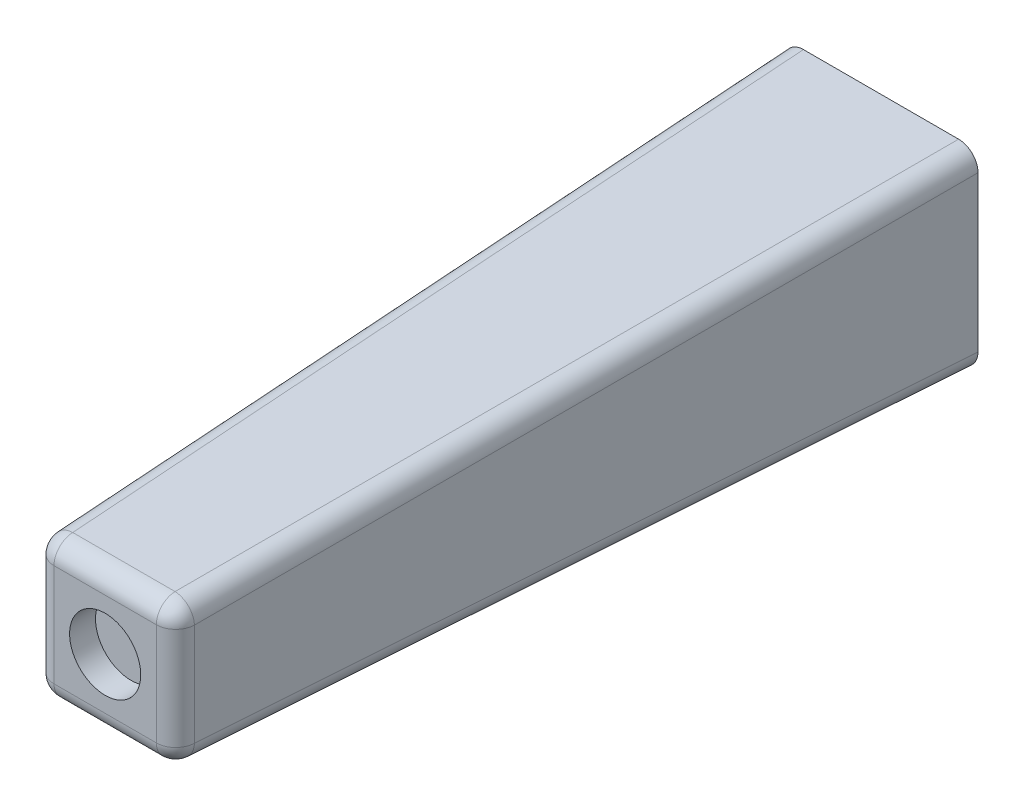
ISO-10303-21;
HEADER;
FILE_DESCRIPTION(('STEP AP214'),'2;1');
FILE_NAME('part.step','',(''),(''),'','','');
FILE_SCHEMA(('AUTOMOTIVE_DESIGN { 1 0 10303 214 1 1 1 1 }'));
ENDSEC;
DATA;
#1=APPLICATION_CONTEXT('core data for automotive mechanical design processes');
#2=APPLICATION_PROTOCOL_DEFINITION('international standard','automotive_design',2000,#1);
#3=PRODUCT_CONTEXT('',#1,'mechanical');
#4=PRODUCT('Part','Part','',(#3));
#5=PRODUCT_RELATED_PRODUCT_CATEGORY('part','',(#4));
#6=PRODUCT_DEFINITION_FORMATION('','',#4);
#7=PRODUCT_DEFINITION_CONTEXT('part definition',#1,'design');
#8=PRODUCT_DEFINITION('design','',#6,#7);
#9=PRODUCT_DEFINITION_SHAPE('','',#8);
#10=(LENGTH_UNIT() NAMED_UNIT(*) SI_UNIT(.MILLI.,.METRE.));
#11=(NAMED_UNIT(*) PLANE_ANGLE_UNIT() SI_UNIT($,.RADIAN.));
#12=(NAMED_UNIT(*) SI_UNIT($,.STERADIAN.) SOLID_ANGLE_UNIT());
#13=UNCERTAINTY_MEASURE_WITH_UNIT(LENGTH_MEASURE(1.E-05),#10,'distance_accuracy_value','');
#14=(GEOMETRIC_REPRESENTATION_CONTEXT(3) GLOBAL_UNCERTAINTY_ASSIGNED_CONTEXT((#13)) GLOBAL_UNIT_ASSIGNED_CONTEXT((#10,
#11,#12)) REPRESENTATION_CONTEXT('',''));
#15=CARTESIAN_POINT('',(0.,0.,0.));
#16=DIRECTION('',(0.,0.,1.));
#17=DIRECTION('',(1.,0.,0.));
#18=AXIS2_PLACEMENT_3D('',#15,#16,#17);
#19=CARTESIAN_POINT('',(7.5,-7.5,0.));
#20=DIRECTION('',(0.999390827019096,0.,0.034899496702501));
#21=DIRECTION('',(0.034899496702501,0.,-0.999390827019096));
#22=AXIS2_PLACEMENT_3D('',#19,#20,#21);
#23=PLANE('',#22);
#24=DIRECTION('',(0.,1.,0.));
#25=VECTOR('',#24,1.);
#26=CARTESIAN_POINT('',(7.5,-7.5,0.));
#27=LINE('',#26,#25);
#28=CARTESIAN_POINT('',(7.5,-6.00091375947136,0.));
#29=VERTEX_POINT('',#28);
#30=CARTESIAN_POINT('',(7.5,6.00091375947136,0.));
#31=VERTEX_POINT('',#30);
#32=EDGE_CURVE('E221',#29,#31,#27,.T.);
#33=ORIENTED_EDGE('',*,*,#32,.T.);
#34=DIRECTION('',(-0.0348782627423747,-0.0348782627423747,0.998782765958718));
#35=VECTOR('',#34,1.);
#36=CARTESIAN_POINT('',(7.4835762300568,5.98448998952816,0.470315235953722));
#37=LINE('',#36,#35);
#38=CARTESIAN_POINT('',(5.45530690881317,3.95622066828452,58.5523492450537));
#39=VERTEX_POINT('',#38);
#40=EDGE_CURVE('E168',#31,#39,#37,.T.);
#41=ORIENTED_EDGE('',*,*,#40,.T.);
#42=DIRECTION('',(0.,1.,0.));
#43=VECTOR('',#42,1.);
#44=CARTESIAN_POINT('',(5.45530690881316,-7.5,58.5523492450537));
#45=LINE('',#44,#43);
#46=CARTESIAN_POINT('',(5.45530690881317,-3.95622066828452,58.5523492450537));
#47=VERTEX_POINT('',#46);
#48=EDGE_CURVE('E166',#39,#47,#45,.F.);
#49=ORIENTED_EDGE('',*,*,#48,.T.);
#50=DIRECTION('',(-0.0348782627423747,0.0348782627423747,0.998782765958718));
#51=VECTOR('',#50,1.);
#52=CARTESIAN_POINT('',(7.50182362823569,-6.00273738770705,-0.0522218800512369));
#53=LINE('',#52,#51);
#54=EDGE_CURVE('E164',#47,#29,#53,.F.);
#55=ORIENTED_EDGE('',*,*,#54,.T.);
#56=EDGE_LOOP('',(#33,#41,#49,#55));
#57=FACE_BOUND('',#56,.T.);
#58=ADVANCED_FACE('F41',(#57),#23,.T.);
#59=CARTESIAN_POINT('',(-7.5,7.5,0.));
#60=DIRECTION('',(0.,0.999390827019096,0.034899496702501));
#61=DIRECTION('',(0.,-0.034899496702501,0.999390827019096));
#62=AXIS2_PLACEMENT_3D('',#59,#60,#61);
#63=PLANE('',#62);
#64=DIRECTION('',(-1.,0.,0.));
#65=VECTOR('',#64,1.);
#66=CARTESIAN_POINT('',(-7.5,5.45530690881316,58.5523492450537));
#67=LINE('',#66,#65);
#68=CARTESIAN_POINT('',(-3.95622066828452,5.45530690881316,58.5523492450537));
#69=VERTEX_POINT('',#68);
#70=CARTESIAN_POINT('',(3.95622066828452,5.45530690881317,58.5523492450537));
#71=VERTEX_POINT('',#70);
#72=EDGE_CURVE('E126',#69,#71,#67,.F.);
#73=ORIENTED_EDGE('',*,*,#72,.T.);
#74=DIRECTION('',(-0.0348782627423747,-0.0348782627423747,0.998782765958718));
#75=VECTOR('',#74,1.);
#76=CARTESIAN_POINT('',(5.98448998952816,7.4835762300568,0.470315235953722));
#77=LINE('',#76,#75);
#78=CARTESIAN_POINT('',(6.00091375947136,7.5,0.));
#79=VERTEX_POINT('',#78);
#80=EDGE_CURVE('E162',#71,#79,#77,.F.);
#81=ORIENTED_EDGE('',*,*,#80,.T.);
#82=DIRECTION('',(-1.,0.,0.));
#83=VECTOR('',#82,1.);
#84=CARTESIAN_POINT('',(-7.5,7.5,0.));
#85=LINE('',#84,#83);
#86=CARTESIAN_POINT('',(-6.00091375947135,7.5,0.));
#87=VERTEX_POINT('',#86);
#88=EDGE_CURVE('E226',#79,#87,#85,.T.);
#89=ORIENTED_EDGE('',*,*,#88,.T.);
#90=DIRECTION('',(0.0348782627423747,-0.0348782627423747,0.998782765958718));
#91=VECTOR('',#90,1.);
#92=CARTESIAN_POINT('',(-6.00273738770705,7.50182362823569,-0.0522218800512369));
#93=LINE('',#92,#91);
#94=EDGE_CURVE('E155',#87,#69,#93,.T.);
#95=ORIENTED_EDGE('',*,*,#94,.T.);
#96=EDGE_LOOP('',(#73,#81,#89,#95));
#97=FACE_BOUND('',#96,.T.);
#98=ADVANCED_FACE('F251',(#97),#63,.T.);
#99=CARTESIAN_POINT('',(-7.5,-7.5,0.));
#100=DIRECTION('',(-0.999390827019096,0.,0.034899496702501));
#101=DIRECTION('',(0.034899496702501,0.,0.999390827019096));
#102=AXIS2_PLACEMENT_3D('',#99,#100,#101);
#103=PLANE('',#102);
#104=DIRECTION('',(0.,-1.,0.));
#105=VECTOR('',#104,1.);
#106=CARTESIAN_POINT('',(-7.5,-7.5,0.));
#107=LINE('',#106,#105);
#108=CARTESIAN_POINT('',(-7.5,6.00091375947135,0.));
#109=VERTEX_POINT('',#108);
#110=CARTESIAN_POINT('',(-7.5,-6.00091375947136,0.));
#111=VERTEX_POINT('',#110);
#112=EDGE_CURVE('E229',#109,#111,#107,.T.);
#113=ORIENTED_EDGE('',*,*,#112,.T.);
#114=DIRECTION('',(0.0348782627423747,0.0348782627423747,0.998782765958718));
#115=VECTOR('',#114,1.);
#116=CARTESIAN_POINT('',(-7.50182362823569,-6.00273738770705,-0.0522218800512369));
#117=LINE('',#116,#115);
#118=CARTESIAN_POINT('',(-5.45530690881316,-3.95622066828452,58.5523492450537));
#119=VERTEX_POINT('',#118);
#120=EDGE_CURVE('E58',#111,#119,#117,.T.);
#121=ORIENTED_EDGE('',*,*,#120,.T.);
#122=DIRECTION('',(0.,-1.,0.));
#123=VECTOR('',#122,1.);
#124=CARTESIAN_POINT('',(-5.45530690881316,-7.5,58.5523492450537));
#125=LINE('',#124,#123);
#126=CARTESIAN_POINT('',(-5.45530690881316,3.95622066828452,58.5523492450537));
#127=VERTEX_POINT('',#126);
#128=EDGE_CURVE('E63',#119,#127,#125,.F.);
#129=ORIENTED_EDGE('',*,*,#128,.T.);
#130=DIRECTION('',(0.0348782627423747,-0.0348782627423747,0.998782765958718));
#131=VECTOR('',#130,1.);
#132=CARTESIAN_POINT('',(-7.4835762300568,5.98448998952816,0.470315235953721));
#133=LINE('',#132,#131);
#134=EDGE_CURVE('E176',#127,#109,#133,.F.);
#135=ORIENTED_EDGE('',*,*,#134,.T.);
#136=EDGE_LOOP('',(#113,#121,#129,#135));
#137=FACE_BOUND('',#136,.T.);
#138=ADVANCED_FACE('F257',(#137),#103,.T.);
#139=CARTESIAN_POINT('',(-7.5,-7.5,0.));
#140=DIRECTION('',(0.,-0.999390827019096,0.034899496702501));
#141=DIRECTION('',(0.,-0.034899496702501,-0.999390827019096));
#142=AXIS2_PLACEMENT_3D('',#139,#140,#141);
#143=PLANE('',#142);
#144=DIRECTION('',(1.,0.,0.));
#145=VECTOR('',#144,1.);
#146=CARTESIAN_POINT('',(-7.5,-5.45530690881316,58.5523492450537));
#147=LINE('',#146,#145);
#148=CARTESIAN_POINT('',(3.95622066828452,-5.45530690881316,58.5523492450537));
#149=VERTEX_POINT('',#148);
#150=CARTESIAN_POINT('',(-3.95622066828452,-5.45530690881316,58.5523492450537));
#151=VERTEX_POINT('',#150);
#152=EDGE_CURVE('E172',#149,#151,#147,.F.);
#153=ORIENTED_EDGE('',*,*,#152,.T.);
#154=DIRECTION('',(0.0348782627423747,0.0348782627423747,0.998782765958718));
#155=VECTOR('',#154,1.);
#156=CARTESIAN_POINT('',(-6.00273738770705,-7.50182362823569,-0.0522218800512369));
#157=LINE('',#156,#155);
#158=CARTESIAN_POINT('',(-6.00091375947136,-7.5,0.));
#159=VERTEX_POINT('',#158);
#160=EDGE_CURVE('E174',#151,#159,#157,.F.);
#161=ORIENTED_EDGE('',*,*,#160,.T.);
#162=DIRECTION('',(1.,0.,0.));
#163=VECTOR('',#162,1.);
#164=CARTESIAN_POINT('',(-7.5,-7.5,0.));
#165=LINE('',#164,#163);
#166=CARTESIAN_POINT('',(6.00091375947136,-7.5,0.));
#167=VERTEX_POINT('',#166);
#168=EDGE_CURVE('E148',#159,#167,#165,.T.);
#169=ORIENTED_EDGE('',*,*,#168,.T.);
#170=DIRECTION('',(-0.0348782627423747,0.0348782627423747,0.998782765958718));
#171=VECTOR('',#170,1.);
#172=CARTESIAN_POINT('',(5.98448998952816,-7.4835762300568,0.470315235953722));
#173=LINE('',#172,#171);
#174=EDGE_CURVE('E170',#167,#149,#173,.T.);
#175=ORIENTED_EDGE('',*,*,#174,.T.);
#176=EDGE_LOOP('',(#153,#161,#169,#175));
#177=FACE_BOUND('',#176,.T.);
#178=ADVANCED_FACE('F286',(#177),#143,.T.);
#179=CARTESIAN_POINT('',(0.,0.,60.));
#180=DIRECTION('',(0.,0.,-1.));
#181=DIRECTION('',(-1.,0.,0.));
#182=AXIS2_PLACEMENT_3D('',#179,#180,#181);
#183=PLANE('',#182);
#184=DIRECTION('',(0.,-1.,0.));
#185=VECTOR('',#184,1.);
#186=CARTESIAN_POINT('',(3.95622066828452,0.,60.));
#187=LINE('',#186,#185);
#188=CARTESIAN_POINT('',(3.95622066828452,-3.95622066828452,60.));
#189=VERTEX_POINT('',#188);
#190=CARTESIAN_POINT('',(3.95622066828452,3.95622066828452,60.));
#191=VERTEX_POINT('',#190);
#192=EDGE_CURVE('E153',#189,#191,#187,.F.);
#193=ORIENTED_EDGE('',*,*,#192,.T.);
#194=DIRECTION('',(1.,0.,0.));
#195=VECTOR('',#194,1.);
#196=CARTESIAN_POINT('',(0.,3.95622066828452,60.));
#197=LINE('',#196,#195);
#198=CARTESIAN_POINT('',(-3.95622066828452,3.95622066828452,60.));
#199=VERTEX_POINT('',#198);
#200=EDGE_CURVE('E124',#191,#199,#197,.F.);
#201=ORIENTED_EDGE('',*,*,#200,.T.);
#202=DIRECTION('',(0.,1.,0.));
#203=VECTOR('',#202,1.);
#204=CARTESIAN_POINT('',(-3.95622066828452,0.,60.));
#205=LINE('',#204,#203);
#206=CARTESIAN_POINT('',(-3.95622066828452,-3.95622066828452,60.));
#207=VERTEX_POINT('',#206);
#208=EDGE_CURVE('E141',#199,#207,#205,.F.);
#209=ORIENTED_EDGE('',*,*,#208,.T.);
#210=DIRECTION('',(-1.,0.,0.));
#211=VECTOR('',#210,1.);
#212=CARTESIAN_POINT('',(0.,-3.95622066828452,60.));
#213=LINE('',#212,#211);
#214=EDGE_CURVE('E147',#207,#189,#213,.F.);
#215=ORIENTED_EDGE('',*,*,#214,.T.);
#216=EDGE_LOOP('',(#193,#201,#209,#215));
#217=FACE_BOUND('',#216,.T.);
#218=CARTESIAN_POINT('',(0.,0.,60.));
#219=DIRECTION('',(0.,0.,1.));
#220=DIRECTION('',(1.,0.,0.));
#221=AXIS2_PLACEMENT_3D('',#218,#219,#220);
#222=CIRCLE('',#221,2.75);
#223=CARTESIAN_POINT('',(2.75,0.,60.));
#224=VERTEX_POINT('',#223);
#225=EDGE_CURVE('E207',#224,#224,#222,.T.);
#226=ORIENTED_EDGE('',*,*,#225,.F.);
#227=EDGE_LOOP('',(#226));
#228=FACE_BOUND('',#227,.T.);
#229=ADVANCED_FACE('F150',(#217,#228),#183,.F.);
#230=CARTESIAN_POINT('',(0.,0.,0.));
#231=DIRECTION('',(0.,0.,-1.));
#232=DIRECTION('',(-1.,0.,0.));
#233=AXIS2_PLACEMENT_3D('',#230,#231,#232);
#234=PLANE('',#233);
#235=CARTESIAN_POINT('',(0.,0.,0.));
#236=DIRECTION('',(0.,0.,-1.));
#237=DIRECTION('',(-1.,0.,0.));
#238=AXIS2_PLACEMENT_3D('',#235,#236,#237);
#239=CIRCLE('',#238,1.5);
#240=CARTESIAN_POINT('',(-1.5,0.,0.));
#241=VERTEX_POINT('',#240);
#242=EDGE_CURVE('E215',#241,#241,#239,.T.);
#243=ORIENTED_EDGE('',*,*,#242,.F.);
#244=EDGE_LOOP('',(#243));
#245=FACE_BOUND('',#244,.T.);
#246=ORIENTED_EDGE('',*,*,#168,.F.);
#247=CARTESIAN_POINT('',(-5.99908568355177,-5.99908568355177,0.));
#248=DIRECTION('',(0.,0.,-1.));
#249=DIRECTION('',(-0.707106781186548,-0.707106781186547,0.));
#250=AXIS2_PLACEMENT_3D('',#247,#248,#249);
#251=ELLIPSE('',#250,1.50182807625857,1.5);
#252=EDGE_CURVE('E11',#159,#111,#251,.T.);
#253=ORIENTED_EDGE('',*,*,#252,.T.);
#254=ORIENTED_EDGE('',*,*,#112,.F.);
#255=CARTESIAN_POINT('',(-5.99908568355177,5.99908568355177,0.));
#256=DIRECTION('',(0.,0.,-1.));
#257=DIRECTION('',(-0.707106781186548,0.707106781186548,0.));
#258=AXIS2_PLACEMENT_3D('',#255,#256,#257);
#259=ELLIPSE('',#258,1.50182807625857,1.5);
#260=EDGE_CURVE('E182',#109,#87,#259,.T.);
#261=ORIENTED_EDGE('',*,*,#260,.T.);
#262=ORIENTED_EDGE('',*,*,#88,.F.);
#263=CARTESIAN_POINT('',(5.99908568355177,5.99908568355177,0.));
#264=DIRECTION('',(0.,0.,-1.));
#265=DIRECTION('',(0.707106781186548,0.707106781186548,0.));
#266=AXIS2_PLACEMENT_3D('',#263,#264,#265);
#267=ELLIPSE('',#266,1.50182807625857,1.5);
#268=EDGE_CURVE('E50',#79,#31,#267,.T.);
#269=ORIENTED_EDGE('',*,*,#268,.T.);
#270=ORIENTED_EDGE('',*,*,#32,.F.);
#271=CARTESIAN_POINT('',(5.99908568355177,-5.99908568355177,0.));
#272=DIRECTION('',(0.,0.,-1.));
#273=DIRECTION('',(0.707106781186547,-0.707106781186548,0.));
#274=AXIS2_PLACEMENT_3D('',#271,#272,#273);
#275=ELLIPSE('',#274,1.50182807625857,1.5);
#276=EDGE_CURVE('E180',#29,#167,#275,.T.);
#277=ORIENTED_EDGE('',*,*,#276,.T.);
#278=EDGE_LOOP('',(#246,#253,#254,#261,#262,#269,#270,#277));
#279=FACE_BOUND('',#278,.T.);
#280=ADVANCED_FACE('F260',(#245,#279),#234,.T.);
#281=CARTESIAN_POINT('',(0.,0.,10.));
#282=DIRECTION('',(0.,0.,-1.));
#283=DIRECTION('',(-1.,0.,0.));
#284=AXIS2_PLACEMENT_3D('',#281,#282,#283);
#285=CYLINDRICAL_SURFACE('',#284,1.5);
#286=CARTESIAN_POINT('',(0.,0.,10.));
#287=DIRECTION('',(0.,0.,-1.));
#288=DIRECTION('',(-1.,0.,0.));
#289=AXIS2_PLACEMENT_3D('',#286,#287,#288);
#290=CIRCLE('',#289,1.5);
#291=CARTESIAN_POINT('',(-1.5,0.,10.));
#292=VERTEX_POINT('',#291);
#293=EDGE_CURVE('E218',#292,#292,#290,.T.);
#294=ORIENTED_EDGE('',*,*,#293,.F.);
#295=EDGE_LOOP('',(#294));
#296=FACE_BOUND('',#295,.T.);
#297=ORIENTED_EDGE('',*,*,#242,.T.);
#298=EDGE_LOOP('',(#297));
#299=FACE_BOUND('',#298,.T.);
#300=ADVANCED_FACE('F397',(#296,#299),#285,.F.);
#301=CARTESIAN_POINT('',(0.,0.,10.));
#302=DIRECTION('',(0.,0.,-1.));
#303=DIRECTION('',(-1.,0.,0.));
#304=AXIS2_PLACEMENT_3D('',#301,#302,#303);
#305=PLANE('',#304);
#306=ORIENTED_EDGE('',*,*,#293,.T.);
#307=EDGE_LOOP('',(#306));
#308=FACE_BOUND('',#307,.T.);
#309=ADVANCED_FACE('F388',(#308),#305,.T.);
#310=CARTESIAN_POINT('',(0.,0.,58.));
#311=DIRECTION('',(0.,0.,1.));
#312=DIRECTION('',(1.,0.,0.));
#313=AXIS2_PLACEMENT_3D('',#310,#311,#312);
#314=CYLINDRICAL_SURFACE('',#313,2.75);
#315=CARTESIAN_POINT('',(0.,0.,58.));
#316=DIRECTION('',(0.,0.,1.));
#317=DIRECTION('',(1.,0.,0.));
#318=AXIS2_PLACEMENT_3D('',#315,#316,#317);
#319=CIRCLE('',#318,2.75);
#320=CARTESIAN_POINT('',(2.75,0.,58.));
#321=VERTEX_POINT('',#320);
#322=EDGE_CURVE('E210',#321,#321,#319,.T.);
#323=ORIENTED_EDGE('',*,*,#322,.F.);
#324=EDGE_LOOP('',(#323));
#325=FACE_BOUND('',#324,.T.);
#326=ORIENTED_EDGE('',*,*,#225,.T.);
#327=EDGE_LOOP('',(#326));
#328=FACE_BOUND('',#327,.T.);
#329=ADVANCED_FACE('F379',(#325,#328),#314,.F.);
#330=CARTESIAN_POINT('',(0.,0.,58.));
#331=DIRECTION('',(0.,0.,1.));
#332=DIRECTION('',(1.,0.,0.));
#333=AXIS2_PLACEMENT_3D('',#330,#331,#332);
#334=PLANE('',#333);
#335=ORIENTED_EDGE('',*,*,#322,.T.);
#336=EDGE_LOOP('',(#335));
#337=FACE_BOUND('',#336,.T.);
#338=ADVANCED_FACE('F372',(#337),#334,.T.);
#339=CARTESIAN_POINT('',(6.00273738770705,-6.00273738770705,-0.104571125104988));
#340=DIRECTION('',(0.0348782627423747,-0.0348782627423747,-0.998782765958718));
#341=DIRECTION('',(0.,0.999390827019096,-0.034899496702501));
#342=AXIS2_PLACEMENT_3D('',#339,#340,#341);
#343=CYLINDRICAL_SURFACE('',#342,1.5);
#344=ORIENTED_EDGE('',*,*,#276,.F.);
#345=ORIENTED_EDGE('',*,*,#54,.F.);
#346=CARTESIAN_POINT('',(3.95622066828452,-3.95622066828452,58.5));
#347=DIRECTION('',(-0.0348782627423725,0.0348782627423725,0.998782765958718));
#348=DIRECTION('',(0.,-0.999390827019096,0.0348994967024989));
#349=AXIS2_PLACEMENT_3D('',#346,#347,#348);
#350=CIRCLE('',#349,1.5);
#351=EDGE_CURVE('E45',#149,#47,#350,.T.);
#352=ORIENTED_EDGE('',*,*,#351,.F.);
#353=ORIENTED_EDGE('',*,*,#174,.F.);
#354=EDGE_LOOP('',(#344,#345,#352,#353));
#355=FACE_BOUND('',#354,.T.);
#356=ADVANCED_FACE('F43',(#355),#343,.T.);
#357=CARTESIAN_POINT('',(0.,-3.95622066828452,58.5));
#358=DIRECTION('',(-1.,0.,0.));
#359=DIRECTION('',(0.,0.,1.));
#360=AXIS2_PLACEMENT_3D('',#357,#358,#359);
#361=CYLINDRICAL_SURFACE('',#360,1.5);
#362=CARTESIAN_POINT('',(-3.95622066828452,-3.95622066828452,58.5));
#363=DIRECTION('',(-1.,0.,0.));
#364=DIRECTION('',(0.,0.,1.));
#365=AXIS2_PLACEMENT_3D('',#362,#363,#364);
#366=CIRCLE('',#365,1.5);
#367=EDGE_CURVE('E199',#151,#207,#366,.T.);
#368=ORIENTED_EDGE('',*,*,#367,.F.);
#369=ORIENTED_EDGE('',*,*,#152,.F.);
#370=CARTESIAN_POINT('',(3.95622066828452,-3.95622066828452,58.5));
#371=DIRECTION('',(1.,0.,0.));
#372=DIRECTION('',(0.,1.,0.));
#373=AXIS2_PLACEMENT_3D('',#370,#371,#372);
#374=CIRCLE('',#373,1.5);
#375=EDGE_CURVE('E201',#189,#149,#374,.T.);
#376=ORIENTED_EDGE('',*,*,#375,.F.);
#377=ORIENTED_EDGE('',*,*,#214,.F.);
#378=EDGE_LOOP('',(#368,#369,#376,#377));
#379=FACE_BOUND('',#378,.T.);
#380=ADVANCED_FACE('F235',(#379),#361,.T.);
#381=CARTESIAN_POINT('',(-6.00273738770705,-6.00273738770705,-0.104571125104988));
#382=DIRECTION('',(-0.0348782627423747,-0.0348782627423747,-0.998782765958718));
#383=DIRECTION('',(-0.999390827019096,0.,0.0348994967025011));
#384=AXIS2_PLACEMENT_3D('',#381,#382,#383);
#385=CYLINDRICAL_SURFACE('',#384,1.5);
#386=ORIENTED_EDGE('',*,*,#252,.F.);
#387=ORIENTED_EDGE('',*,*,#160,.F.);
#388=CARTESIAN_POINT('',(-3.95622066828452,-3.95622066828452,58.5));
#389=DIRECTION('',(0.0348782627423725,0.0348782627423725,0.998782765958718));
#390=DIRECTION('',(0.,-0.999390827019096,0.0348994967024989));
#391=AXIS2_PLACEMENT_3D('',#388,#389,#390);
#392=CIRCLE('',#391,1.5);
#393=EDGE_CURVE('E196',#119,#151,#392,.T.);
#394=ORIENTED_EDGE('',*,*,#393,.F.);
#395=ORIENTED_EDGE('',*,*,#120,.F.);
#396=EDGE_LOOP('',(#386,#387,#394,#395));
#397=FACE_BOUND('',#396,.T.);
#398=ADVANCED_FACE('F264',(#397),#385,.T.);
#399=CARTESIAN_POINT('',(3.95622066828452,-3.95622066828452,58.5));
#400=DIRECTION('',(0.,0.,1.));
#401=DIRECTION('',(0.,-1.,0.));
#402=AXIS2_PLACEMENT_3D('',#399,#400,#401);
#403=SPHERICAL_SURFACE('',#402,1.5);
#404=ORIENTED_EDGE('',*,*,#375,.T.);
#405=ORIENTED_EDGE('',*,*,#351,.T.);
#406=CARTESIAN_POINT('',(3.95622066828452,-3.95622066828452,58.5));
#407=DIRECTION('',(0.,-1.,0.));
#408=DIRECTION('',(0.,0.,-1.));
#409=AXIS2_PLACEMENT_3D('',#406,#407,#408);
#410=CIRCLE('',#409,1.5);
#411=EDGE_CURVE('E193',#189,#47,#410,.F.);
#412=ORIENTED_EDGE('',*,*,#411,.F.);
#413=EDGE_LOOP('',(#404,#405,#412));
#414=FACE_BOUND('',#413,.T.);
#415=ADVANCED_FACE('F236',(#414),#403,.T.);
#416=CARTESIAN_POINT('',(-3.95622066828452,-3.95622066828452,58.5));
#417=DIRECTION('',(0.,0.,1.));
#418=DIRECTION('',(0.,-1.,0.));
#419=AXIS2_PLACEMENT_3D('',#416,#417,#418);
#420=SPHERICAL_SURFACE('',#419,1.5);
#421=ORIENTED_EDGE('',*,*,#393,.T.);
#422=ORIENTED_EDGE('',*,*,#367,.T.);
#423=CARTESIAN_POINT('',(-3.95622066828452,-3.95622066828452,58.5));
#424=DIRECTION('',(0.,-1.,0.));
#425=DIRECTION('',(1.,0.,0.));
#426=AXIS2_PLACEMENT_3D('',#423,#424,#425);
#427=CIRCLE('',#426,1.5);
#428=EDGE_CURVE('E144',#119,#207,#427,.F.);
#429=ORIENTED_EDGE('',*,*,#428,.F.);
#430=EDGE_LOOP('',(#421,#422,#429));
#431=FACE_BOUND('',#430,.T.);
#432=ADVANCED_FACE('F266',(#431),#420,.T.);
#433=CARTESIAN_POINT('',(5.98448998952816,5.98448998952816,0.41796599089997));
#434=DIRECTION('',(0.0348782627423747,0.0348782627423747,-0.998782765958718));
#435=DIRECTION('',(-0.999390827019096,0.,-0.0348994967025011));
#436=AXIS2_PLACEMENT_3D('',#433,#434,#435);
#437=CYLINDRICAL_SURFACE('',#436,1.5);
#438=ORIENTED_EDGE('',*,*,#268,.F.);
#439=ORIENTED_EDGE('',*,*,#80,.F.);
#440=CARTESIAN_POINT('',(3.95622066828452,3.95622066828452,58.5));
#441=DIRECTION('',(-0.0348782627423725,-0.0348782627423726,0.998782765958718));
#442=DIRECTION('',(0.,-0.999390827019096,-0.0348994967024989));
#443=AXIS2_PLACEMENT_3D('',#440,#441,#442);
#444=CIRCLE('',#443,1.5);
#445=EDGE_CURVE('E189',#39,#71,#444,.T.);
#446=ORIENTED_EDGE('',*,*,#445,.F.);
#447=ORIENTED_EDGE('',*,*,#40,.F.);
#448=EDGE_LOOP('',(#438,#439,#446,#447));
#449=FACE_BOUND('',#448,.T.);
#450=ADVANCED_FACE('F248',(#449),#437,.T.);
#451=CARTESIAN_POINT('',(3.95622066828452,0.,58.5));
#452=DIRECTION('',(0.,-1.,0.));
#453=DIRECTION('',(1.,0.,0.));
#454=AXIS2_PLACEMENT_3D('',#451,#452,#453);
#455=CYLINDRICAL_SURFACE('',#454,1.5);
#456=ORIENTED_EDGE('',*,*,#411,.T.);
#457=ORIENTED_EDGE('',*,*,#48,.F.);
#458=CARTESIAN_POINT('',(3.95622066828452,3.95622066828452,58.5));
#459=DIRECTION('',(0.,1.,0.));
#460=DIRECTION('',(-1.,0.,0.));
#461=AXIS2_PLACEMENT_3D('',#458,#459,#460);
#462=CIRCLE('',#461,1.5);
#463=EDGE_CURVE('E138',#191,#39,#462,.T.);
#464=ORIENTED_EDGE('',*,*,#463,.F.);
#465=ORIENTED_EDGE('',*,*,#192,.F.);
#466=EDGE_LOOP('',(#456,#457,#464,#465));
#467=FACE_BOUND('',#466,.T.);
#468=ADVANCED_FACE('F239',(#467),#455,.T.);
#469=CARTESIAN_POINT('',(-3.95622066828452,0.,58.5));
#470=DIRECTION('',(0.,1.,0.));
#471=DIRECTION('',(-1.,0.,0.));
#472=AXIS2_PLACEMENT_3D('',#469,#470,#471);
#473=CYLINDRICAL_SURFACE('',#472,1.5);
#474=ORIENTED_EDGE('',*,*,#428,.T.);
#475=ORIENTED_EDGE('',*,*,#208,.F.);
#476=CARTESIAN_POINT('',(-3.95622066828452,3.95622066828452,58.5));
#477=DIRECTION('',(0.,1.,0.));
#478=DIRECTION('',(0.,0.,1.));
#479=AXIS2_PLACEMENT_3D('',#476,#477,#478);
#480=CIRCLE('',#479,1.5);
#481=EDGE_CURVE('E132',#127,#199,#480,.T.);
#482=ORIENTED_EDGE('',*,*,#481,.F.);
#483=ORIENTED_EDGE('',*,*,#128,.F.);
#484=EDGE_LOOP('',(#474,#475,#482,#483));
#485=FACE_BOUND('',#484,.T.);
#486=ADVANCED_FACE('F142',(#485),#473,.T.);
#487=CARTESIAN_POINT('',(-5.98448998952816,5.98448998952816,0.41796599089997));
#488=DIRECTION('',(-0.0348782627423747,0.0348782627423747,-0.998782765958718));
#489=DIRECTION('',(-0.999390827019096,0.,0.034899496702501));
#490=AXIS2_PLACEMENT_3D('',#487,#488,#489);
#491=CYLINDRICAL_SURFACE('',#490,1.5);
#492=ORIENTED_EDGE('',*,*,#260,.F.);
#493=ORIENTED_EDGE('',*,*,#134,.F.);
#494=CARTESIAN_POINT('',(-3.95622066828452,3.95622066828452,58.5));
#495=DIRECTION('',(0.0348782627423725,-0.0348782627423725,0.998782765958718));
#496=DIRECTION('',(0.,-0.999390827019096,-0.0348994967024989));
#497=AXIS2_PLACEMENT_3D('',#494,#495,#496);
#498=CIRCLE('',#497,1.5);
#499=EDGE_CURVE('E136',#69,#127,#498,.T.);
#500=ORIENTED_EDGE('',*,*,#499,.F.);
#501=ORIENTED_EDGE('',*,*,#94,.F.);
#502=EDGE_LOOP('',(#492,#493,#500,#501));
#503=FACE_BOUND('',#502,.T.);
#504=ADVANCED_FACE('F255',(#503),#491,.T.);
#505=CARTESIAN_POINT('',(3.95622066828452,3.95622066828452,58.5));
#506=DIRECTION('',(0.,0.,1.));
#507=DIRECTION('',(1.,0.,0.));
#508=AXIS2_PLACEMENT_3D('',#505,#506,#507);
#509=SPHERICAL_SURFACE('',#508,1.5);
#510=ORIENTED_EDGE('',*,*,#463,.T.);
#511=ORIENTED_EDGE('',*,*,#445,.T.);
#512=CARTESIAN_POINT('',(3.95622066828452,3.95622066828452,58.5));
#513=DIRECTION('',(1.,0.,0.));
#514=DIRECTION('',(0.,0.,-1.));
#515=AXIS2_PLACEMENT_3D('',#512,#513,#514);
#516=CIRCLE('',#515,1.5);
#517=EDGE_CURVE('E129',#191,#71,#516,.F.);
#518=ORIENTED_EDGE('',*,*,#517,.F.);
#519=EDGE_LOOP('',(#510,#511,#518));
#520=FACE_BOUND('',#519,.T.);
#521=ADVANCED_FACE('F243',(#520),#509,.T.);
#522=CARTESIAN_POINT('',(-3.95622066828452,3.95622066828452,58.5));
#523=DIRECTION('',(0.,0.,1.));
#524=DIRECTION('',(1.,0.,0.));
#525=AXIS2_PLACEMENT_3D('',#522,#523,#524);
#526=SPHERICAL_SURFACE('',#525,1.5);
#527=ORIENTED_EDGE('',*,*,#499,.T.);
#528=ORIENTED_EDGE('',*,*,#481,.T.);
#529=CARTESIAN_POINT('',(-3.95622066828452,3.95622066828452,58.5));
#530=DIRECTION('',(-1.,0.,0.));
#531=DIRECTION('',(0.,-1.,0.));
#532=AXIS2_PLACEMENT_3D('',#529,#530,#531);
#533=CIRCLE('',#532,1.5);
#534=EDGE_CURVE('E120',#69,#199,#533,.F.);
#535=ORIENTED_EDGE('',*,*,#534,.F.);
#536=EDGE_LOOP('',(#527,#528,#535));
#537=FACE_BOUND('',#536,.T.);
#538=ADVANCED_FACE('F134',(#537),#526,.T.);
#539=CARTESIAN_POINT('',(0.,3.95622066828452,58.5));
#540=DIRECTION('',(1.,0.,0.));
#541=DIRECTION('',(0.,1.,0.));
#542=AXIS2_PLACEMENT_3D('',#539,#540,#541);
#543=CYLINDRICAL_SURFACE('',#542,1.5);
#544=ORIENTED_EDGE('',*,*,#517,.T.);
#545=ORIENTED_EDGE('',*,*,#72,.F.);
#546=ORIENTED_EDGE('',*,*,#534,.T.);
#547=ORIENTED_EDGE('',*,*,#200,.F.);
#548=EDGE_LOOP('',(#544,#545,#546,#547));
#549=FACE_BOUND('',#548,.T.);
#550=ADVANCED_FACE('F122',(#549),#543,.T.);
#551=CLOSED_SHELL('',(#58,#98,#138,#178,#229,#280,#300,#309,#329,#338,#356,#380,#398,#415,#432,
#450,#468,#486,#504,#521,#538,#550));
#552=MANIFOLD_SOLID_BREP('B2',#551);
#553=ADVANCED_BREP_SHAPE_REPRESENTATION('',(#18,#552),#14);
#554=SHAPE_DEFINITION_REPRESENTATION(#9,#553);
ENDSEC;
END-ISO-10303-21;
